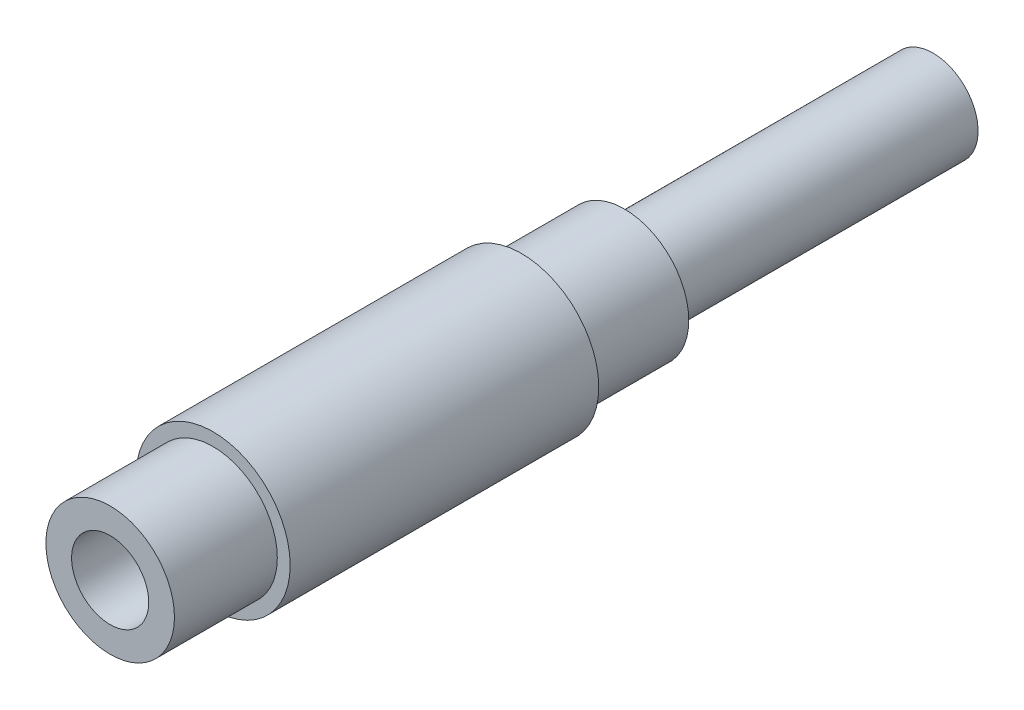
ISO-10303-21;
HEADER;
FILE_DESCRIPTION(('STEP AP214'),'2;1');
FILE_NAME('part.step','',(''),(''),'','','');
FILE_SCHEMA(('AUTOMOTIVE_DESIGN { 1 0 10303 214 1 1 1 1 }'));
ENDSEC;
DATA;
#1=APPLICATION_CONTEXT('core data for automotive mechanical design processes');
#2=APPLICATION_PROTOCOL_DEFINITION('international standard','automotive_design',2000,#1);
#3=PRODUCT_CONTEXT('',#1,'mechanical');
#4=PRODUCT('Part','Part','',(#3));
#5=PRODUCT_RELATED_PRODUCT_CATEGORY('part','',(#4));
#6=PRODUCT_DEFINITION_FORMATION('','',#4);
#7=PRODUCT_DEFINITION_CONTEXT('part definition',#1,'design');
#8=PRODUCT_DEFINITION('design','',#6,#7);
#9=PRODUCT_DEFINITION_SHAPE('','',#8);
#10=(LENGTH_UNIT() NAMED_UNIT(*) SI_UNIT(.MILLI.,.METRE.));
#11=(NAMED_UNIT(*) PLANE_ANGLE_UNIT() SI_UNIT($,.RADIAN.));
#12=(NAMED_UNIT(*) SI_UNIT($,.STERADIAN.) SOLID_ANGLE_UNIT());
#13=UNCERTAINTY_MEASURE_WITH_UNIT(LENGTH_MEASURE(1.E-05),#10,'distance_accuracy_value','');
#14=(GEOMETRIC_REPRESENTATION_CONTEXT(3) GLOBAL_UNCERTAINTY_ASSIGNED_CONTEXT((#13)) GLOBAL_UNIT_ASSIGNED_CONTEXT((#10,
#11,#12)) REPRESENTATION_CONTEXT('',''));
#15=CARTESIAN_POINT('',(0.,0.,0.));
#16=DIRECTION('',(0.,0.,1.));
#17=DIRECTION('',(1.,0.,0.));
#18=AXIS2_PLACEMENT_3D('',#15,#16,#17);
#19=CARTESIAN_POINT('',(0.,0.,63.5));
#20=DIRECTION('',(0.,0.,-1.));
#21=DIRECTION('',(-1.,0.,0.));
#22=AXIS2_PLACEMENT_3D('',#19,#20,#21);
#23=CYLINDRICAL_SURFACE('',#22,7.9375);
#24=CARTESIAN_POINT('',(0.,0.,0.));
#25=DIRECTION('',(0.,0.,1.));
#26=DIRECTION('',(1.,0.,0.));
#27=AXIS2_PLACEMENT_3D('',#24,#25,#26);
#28=CIRCLE('',#27,7.9375);
#29=CARTESIAN_POINT('',(7.9375,0.,0.));
#30=VERTEX_POINT('',#29);
#31=EDGE_CURVE('E49',#30,#30,#28,.T.);
#32=ORIENTED_EDGE('',*,*,#31,.T.);
#33=EDGE_LOOP('',(#32));
#34=FACE_BOUND('',#33,.T.);
#35=CARTESIAN_POINT('',(0.,0.,12.7));
#36=DIRECTION('',(0.,0.,1.));
#37=DIRECTION('',(1.,0.,0.));
#38=AXIS2_PLACEMENT_3D('',#35,#36,#37);
#39=CIRCLE('',#38,7.9375);
#40=CARTESIAN_POINT('',(7.9375,0.,12.7));
#41=VERTEX_POINT('',#40);
#42=EDGE_CURVE('E11',#41,#41,#39,.T.);
#43=ORIENTED_EDGE('',*,*,#42,.F.);
#44=EDGE_LOOP('',(#43));
#45=FACE_BOUND('',#44,.T.);
#46=ADVANCED_FACE('F33',(#34,#45),#23,.T.);
#47=CARTESIAN_POINT('',(0.,0.,0.));
#48=DIRECTION('',(0.,0.,1.));
#49=DIRECTION('',(1.,0.,0.));
#50=AXIS2_PLACEMENT_3D('',#47,#48,#49);
#51=PLANE('',#50);
#52=CARTESIAN_POINT('',(0.,0.,0.));
#53=DIRECTION('',(0.,0.,-1.));
#54=DIRECTION('',(-1.,0.,0.));
#55=AXIS2_PLACEMENT_3D('',#52,#53,#54);
#56=CIRCLE('',#55,5.5626);
#57=CARTESIAN_POINT('',(-5.5626,0.,0.));
#58=VERTEX_POINT('',#57);
#59=EDGE_CURVE('E40',#58,#58,#56,.T.);
#60=ORIENTED_EDGE('',*,*,#59,.F.);
#61=EDGE_LOOP('',(#60));
#62=FACE_BOUND('',#61,.T.);
#63=ORIENTED_EDGE('',*,*,#31,.F.);
#64=EDGE_LOOP('',(#63));
#65=FACE_BOUND('',#64,.T.);
#66=ADVANCED_FACE('F95',(#62,#65),#51,.F.);
#67=CARTESIAN_POINT('',(0.,0.,-38.1));
#68=DIRECTION('',(0.,0.,1.));
#69=DIRECTION('',(1.,0.,0.));
#70=AXIS2_PLACEMENT_3D('',#67,#68,#69);
#71=CYLINDRICAL_SURFACE('',#70,5.5626);
#72=CARTESIAN_POINT('',(0.,0.,-38.1));
#73=DIRECTION('',(0.,0.,-1.));
#74=DIRECTION('',(-1.,0.,0.));
#75=AXIS2_PLACEMENT_3D('',#72,#73,#74);
#76=CIRCLE('',#75,5.5626);
#77=CARTESIAN_POINT('',(-5.5626,0.,-38.1));
#78=VERTEX_POINT('',#77);
#79=EDGE_CURVE('E52',#78,#78,#76,.T.);
#80=ORIENTED_EDGE('',*,*,#79,.F.);
#81=EDGE_LOOP('',(#80));
#82=FACE_BOUND('',#81,.T.);
#83=ORIENTED_EDGE('',*,*,#59,.T.);
#84=EDGE_LOOP('',(#83));
#85=FACE_BOUND('',#84,.T.);
#86=ADVANCED_FACE('F100',(#82,#85),#71,.T.);
#87=CARTESIAN_POINT('',(0.,0.,-38.1));
#88=DIRECTION('',(0.,0.,-1.));
#89=DIRECTION('',(-1.,0.,0.));
#90=AXIS2_PLACEMENT_3D('',#87,#88,#89);
#91=PLANE('',#90);
#92=ORIENTED_EDGE('',*,*,#79,.T.);
#93=EDGE_LOOP('',(#92));
#94=FACE_BOUND('',#93,.T.);
#95=ADVANCED_FACE('F108',(#94),#91,.T.);
#96=CARTESIAN_POINT('',(0.,0.,90.4407683632075));
#97=DIRECTION('',(0.,0.,-1.));
#98=DIRECTION('',(-1.,0.,0.));
#99=AXIS2_PLACEMENT_3D('',#96,#97,#98);
#100=CYLINDRICAL_SURFACE('',#99,9.525);
#101=CARTESIAN_POINT('',(0.,0.,12.7));
#102=DIRECTION('',(0.,0.,1.));
#103=DIRECTION('',(1.,0.,0.));
#104=AXIS2_PLACEMENT_3D('',#101,#102,#103);
#105=CIRCLE('',#104,9.525);
#106=CARTESIAN_POINT('',(9.525,0.,12.7));
#107=VERTEX_POINT('',#106);
#108=EDGE_CURVE('E63',#107,#107,#105,.T.);
#109=ORIENTED_EDGE('',*,*,#108,.T.);
#110=EDGE_LOOP('',(#109));
#111=FACE_BOUND('',#110,.T.);
#112=CARTESIAN_POINT('',(0.,0.,50.8));
#113=DIRECTION('',(0.,0.,1.));
#114=DIRECTION('',(1.,0.,0.));
#115=AXIS2_PLACEMENT_3D('',#112,#113,#114);
#116=CIRCLE('',#115,9.525);
#117=CARTESIAN_POINT('',(9.525,0.,50.8));
#118=VERTEX_POINT('',#117);
#119=EDGE_CURVE('E58',#118,#118,#116,.T.);
#120=ORIENTED_EDGE('',*,*,#119,.F.);
#121=EDGE_LOOP('',(#120));
#122=FACE_BOUND('',#121,.T.);
#123=ADVANCED_FACE('F114',(#111,#122),#100,.T.);
#124=CARTESIAN_POINT('',(0.,0.,12.7));
#125=DIRECTION('',(0.,0.,1.));
#126=DIRECTION('',(1.,0.,0.));
#127=AXIS2_PLACEMENT_3D('',#124,#125,#126);
#128=PLANE('',#127);
#129=ORIENTED_EDGE('',*,*,#42,.T.);
#130=EDGE_LOOP('',(#129));
#131=FACE_BOUND('',#130,.T.);
#132=ORIENTED_EDGE('',*,*,#108,.F.);
#133=EDGE_LOOP('',(#132));
#134=FACE_BOUND('',#133,.T.);
#135=ADVANCED_FACE('F118',(#131,#134),#128,.F.);
#136=CARTESIAN_POINT('',(0.,0.,50.8));
#137=DIRECTION('',(0.,0.,1.));
#138=DIRECTION('',(1.,0.,0.));
#139=AXIS2_PLACEMENT_3D('',#136,#137,#138);
#140=PLANE('',#139);
#141=CARTESIAN_POINT('',(0.,0.,50.8));
#142=DIRECTION('',(0.,0.,1.));
#143=DIRECTION('',(1.,0.,0.));
#144=AXIS2_PLACEMENT_3D('',#141,#142,#143);
#145=CIRCLE('',#144,7.9375);
#146=CARTESIAN_POINT('',(7.9375,0.,50.8));
#147=VERTEX_POINT('',#146);
#148=EDGE_CURVE('E56',#147,#147,#145,.T.);
#149=ORIENTED_EDGE('',*,*,#148,.F.);
#150=EDGE_LOOP('',(#149));
#151=FACE_BOUND('',#150,.T.);
#152=ORIENTED_EDGE('',*,*,#119,.T.);
#153=EDGE_LOOP('',(#152));
#154=FACE_BOUND('',#153,.T.);
#155=ADVANCED_FACE('F87',(#151,#154),#140,.T.);
#156=CARTESIAN_POINT('',(0.,0.,63.5));
#157=DIRECTION('',(0.,0.,1.));
#158=DIRECTION('',(1.,0.,0.));
#159=AXIS2_PLACEMENT_3D('',#156,#157,#158);
#160=PLANE('',#159);
#161=CARTESIAN_POINT('',(0.,0.,63.5));
#162=DIRECTION('',(0.,0.,1.));
#163=DIRECTION('',(1.,0.,0.));
#164=AXIS2_PLACEMENT_3D('',#161,#162,#163);
#165=CIRCLE('',#164,4.7625);
#166=CARTESIAN_POINT('',(4.7625,0.,63.5));
#167=VERTEX_POINT('',#166);
#168=EDGE_CURVE('E70',#167,#167,#165,.T.);
#169=ORIENTED_EDGE('',*,*,#168,.F.);
#170=EDGE_LOOP('',(#169));
#171=FACE_BOUND('',#170,.T.);
#172=CARTESIAN_POINT('',(0.,0.,63.5));
#173=DIRECTION('',(0.,0.,1.));
#174=DIRECTION('',(1.,0.,0.));
#175=AXIS2_PLACEMENT_3D('',#172,#173,#174);
#176=CIRCLE('',#175,7.9375);
#177=CARTESIAN_POINT('',(7.9375,0.,63.5));
#178=VERTEX_POINT('',#177);
#179=EDGE_CURVE('E44',#178,#178,#176,.T.);
#180=ORIENTED_EDGE('',*,*,#179,.T.);
#181=EDGE_LOOP('',(#180));
#182=FACE_BOUND('',#181,.T.);
#183=ADVANCED_FACE('F84',(#171,#182),#160,.T.);
#184=ORIENTED_EDGE('',*,*,#148,.T.);
#185=EDGE_LOOP('',(#184));
#186=FACE_BOUND('',#185,.T.);
#187=ORIENTED_EDGE('',*,*,#179,.F.);
#188=EDGE_LOOP('',(#187));
#189=FACE_BOUND('',#188,.T.);
#190=ADVANCED_FACE('F35',(#186,#189),#23,.T.);
#191=CARTESIAN_POINT('',(0.,0.,25.4));
#192=DIRECTION('',(0.,0.,1.));
#193=DIRECTION('',(1.,0.,0.));
#194=AXIS2_PLACEMENT_3D('',#191,#192,#193);
#195=CYLINDRICAL_SURFACE('',#194,4.7625);
#196=CARTESIAN_POINT('',(0.,0.,25.4));
#197=DIRECTION('',(0.,0.,1.));
#198=DIRECTION('',(1.,0.,0.));
#199=AXIS2_PLACEMENT_3D('',#196,#197,#198);
#200=CIRCLE('',#199,4.7625);
#201=CARTESIAN_POINT('',(4.7625,0.,25.4));
#202=VERTEX_POINT('',#201);
#203=EDGE_CURVE('E67',#202,#202,#200,.T.);
#204=ORIENTED_EDGE('',*,*,#203,.F.);
#205=EDGE_LOOP('',(#204));
#206=FACE_BOUND('',#205,.T.);
#207=ORIENTED_EDGE('',*,*,#168,.T.);
#208=EDGE_LOOP('',(#207));
#209=FACE_BOUND('',#208,.T.);
#210=ADVANCED_FACE('F78',(#206,#209),#195,.F.);
#211=CARTESIAN_POINT('',(0.,0.,25.4));
#212=DIRECTION('',(0.,0.,1.));
#213=DIRECTION('',(1.,0.,0.));
#214=AXIS2_PLACEMENT_3D('',#211,#212,#213);
#215=PLANE('',#214);
#216=ORIENTED_EDGE('',*,*,#203,.T.);
#217=EDGE_LOOP('',(#216));
#218=FACE_BOUND('',#217,.T.);
#219=ADVANCED_FACE('F76',(#218),#215,.T.);
#220=CLOSED_SHELL('',(#46,#66,#86,#95,#123,#135,#155,#183,#190,#210,#219));
#221=MANIFOLD_SOLID_BREP('B2',#220);
#222=ADVANCED_BREP_SHAPE_REPRESENTATION('',(#18,#221),#14);
#223=SHAPE_DEFINITION_REPRESENTATION(#9,#222);
ENDSEC;
END-ISO-10303-21;
